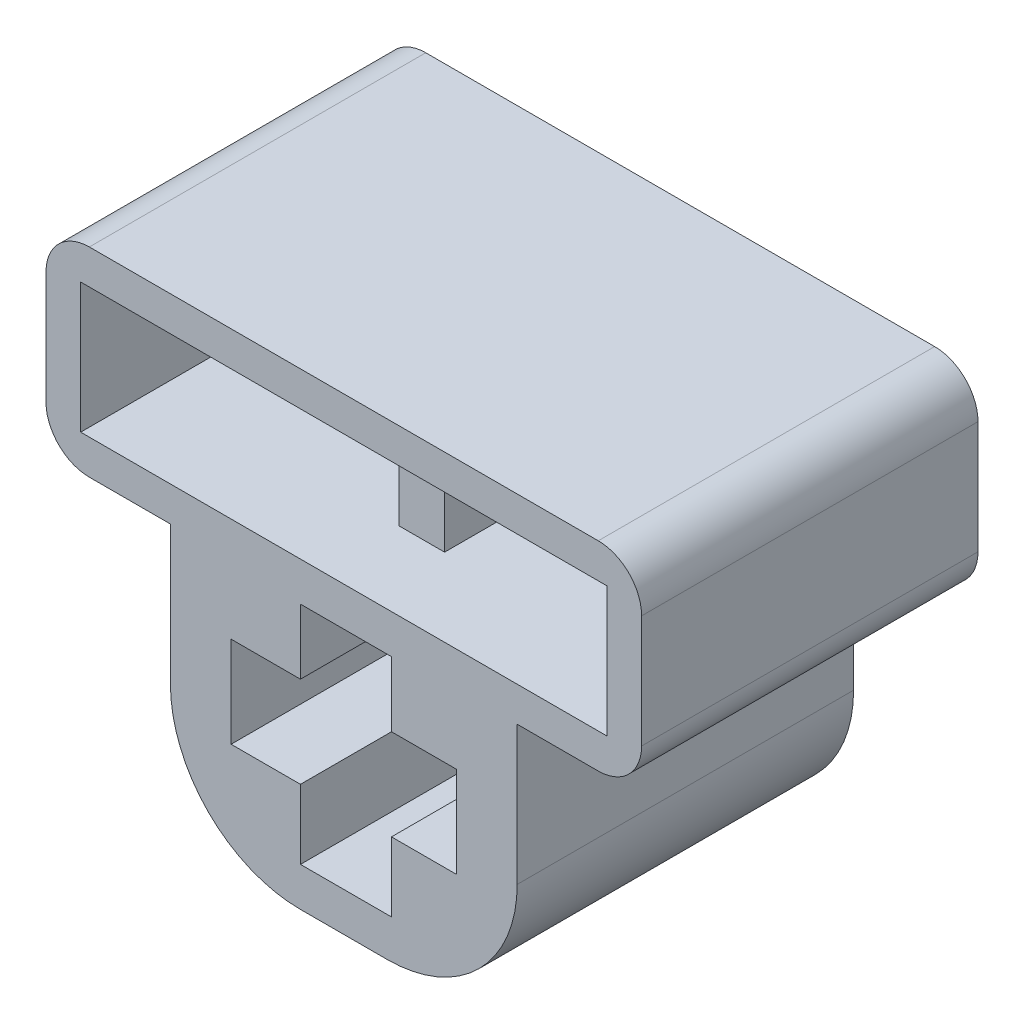
ISO-10303-21;
HEADER;
FILE_DESCRIPTION(('STEP AP214'),'2;1');
FILE_NAME('part.step','',(''),(''),'','','');
FILE_SCHEMA(('AUTOMOTIVE_DESIGN { 1 0 10303 214 1 1 1 1 }'));
ENDSEC;
DATA;
#1=APPLICATION_CONTEXT('core data for automotive mechanical design processes');
#2=APPLICATION_PROTOCOL_DEFINITION('international standard','automotive_design',2000,#1);
#3=PRODUCT_CONTEXT('',#1,'mechanical');
#4=PRODUCT('Part','Part','',(#3));
#5=PRODUCT_RELATED_PRODUCT_CATEGORY('part','',(#4));
#6=PRODUCT_DEFINITION_FORMATION('','',#4);
#7=PRODUCT_DEFINITION_CONTEXT('part definition',#1,'design');
#8=PRODUCT_DEFINITION('design','',#6,#7);
#9=PRODUCT_DEFINITION_SHAPE('','',#8);
#10=(LENGTH_UNIT() NAMED_UNIT(*) SI_UNIT(.MILLI.,.METRE.));
#11=(NAMED_UNIT(*) PLANE_ANGLE_UNIT() SI_UNIT($,.RADIAN.));
#12=(NAMED_UNIT(*) SI_UNIT($,.STERADIAN.) SOLID_ANGLE_UNIT());
#13=UNCERTAINTY_MEASURE_WITH_UNIT(LENGTH_MEASURE(1.E-05),#10,'distance_accuracy_value','');
#14=(GEOMETRIC_REPRESENTATION_CONTEXT(3) GLOBAL_UNCERTAINTY_ASSIGNED_CONTEXT((#13)) GLOBAL_UNIT_ASSIGNED_CONTEXT((#10,
#11,#12)) REPRESENTATION_CONTEXT('',''));
#15=CARTESIAN_POINT('',(0.,0.,0.));
#16=DIRECTION('',(0.,0.,1.));
#17=DIRECTION('',(1.,0.,0.));
#18=AXIS2_PLACEMENT_3D('',#15,#16,#17);
#19=CARTESIAN_POINT('',(-1.,-0.5,7.76));
#20=DIRECTION('',(0.,0.,1.));
#21=DIRECTION('',(1.,0.,0.));
#22=AXIS2_PLACEMENT_3D('',#19,#20,#21);
#23=CYLINDRICAL_SURFACE('',#22,3.);
#24=DIRECTION('',(0.,0.,1.));
#25=VECTOR('',#24,1.);
#26=CARTESIAN_POINT('',(-4.,-0.5,7.76));
#27=LINE('',#26,#25);
#28=CARTESIAN_POINT('',(-4.,-0.5,0.));
#29=VERTEX_POINT('',#28);
#30=CARTESIAN_POINT('',(-4.,-0.5,7.76));
#31=VERTEX_POINT('',#30);
#32=EDGE_CURVE('E523',#29,#31,#27,.T.);
#33=ORIENTED_EDGE('',*,*,#32,.F.);
#34=CARTESIAN_POINT('',(-1.,-0.5,0.));
#35=DIRECTION('',(0.,0.,1.));
#36=DIRECTION('',(1.,0.,0.));
#37=AXIS2_PLACEMENT_3D('',#34,#35,#36);
#38=CIRCLE('',#37,3.);
#39=CARTESIAN_POINT('',(-1.,-3.5,0.));
#40=VERTEX_POINT('',#39);
#41=EDGE_CURVE('E44',#40,#29,#38,.F.);
#42=ORIENTED_EDGE('',*,*,#41,.F.);
#43=DIRECTION('',(0.,0.,1.));
#44=VECTOR('',#43,1.);
#45=CARTESIAN_POINT('',(-1.,-3.5,7.76));
#46=LINE('',#45,#44);
#47=CARTESIAN_POINT('',(-1.,-3.5,7.76));
#48=VERTEX_POINT('',#47);
#49=EDGE_CURVE('E526',#48,#40,#46,.F.);
#50=ORIENTED_EDGE('',*,*,#49,.F.);
#51=CARTESIAN_POINT('',(-1.,-0.5,7.76));
#52=DIRECTION('',(0.,0.,1.));
#53=DIRECTION('',(1.,0.,0.));
#54=AXIS2_PLACEMENT_3D('',#51,#52,#53);
#55=CIRCLE('',#54,3.);
#56=EDGE_CURVE('E11',#31,#48,#55,.T.);
#57=ORIENTED_EDGE('',*,*,#56,.F.);
#58=EDGE_LOOP('',(#33,#42,#50,#57));
#59=FACE_BOUND('',#58,.T.);
#60=ADVANCED_FACE('F37',(#59),#23,.T.);
#61=CARTESIAN_POINT('',(0.999999999999999,-0.5,7.76));
#62=DIRECTION('',(0.,0.,1.));
#63=DIRECTION('',(1.,0.,0.));
#64=AXIS2_PLACEMENT_3D('',#61,#62,#63);
#65=CYLINDRICAL_SURFACE('',#64,3.);
#66=DIRECTION('',(0.,0.,-1.));
#67=VECTOR('',#66,1.);
#68=CARTESIAN_POINT('',(4.,-0.5,7.76));
#69=LINE('',#68,#67);
#70=CARTESIAN_POINT('',(4.,-0.5,7.76));
#71=VERTEX_POINT('',#70);
#72=CARTESIAN_POINT('',(4.,-0.5,0.));
#73=VERTEX_POINT('',#72);
#74=EDGE_CURVE('E512',#71,#73,#69,.T.);
#75=ORIENTED_EDGE('',*,*,#74,.F.);
#76=CARTESIAN_POINT('',(0.999999999999999,-0.5,7.76));
#77=DIRECTION('',(0.,0.,1.));
#78=DIRECTION('',(1.,0.,0.));
#79=AXIS2_PLACEMENT_3D('',#76,#77,#78);
#80=CIRCLE('',#79,3.);
#81=CARTESIAN_POINT('',(0.999999999999999,-3.5,7.76));
#82=VERTEX_POINT('',#81);
#83=EDGE_CURVE('E518',#82,#71,#80,.T.);
#84=ORIENTED_EDGE('',*,*,#83,.F.);
#85=DIRECTION('',(0.,0.,-1.));
#86=VECTOR('',#85,1.);
#87=CARTESIAN_POINT('',(0.999999999999999,-3.5,7.76));
#88=LINE('',#87,#86);
#89=CARTESIAN_POINT('',(0.999999999999999,-3.5,0.));
#90=VERTEX_POINT('',#89);
#91=EDGE_CURVE('E515',#90,#82,#88,.F.);
#92=ORIENTED_EDGE('',*,*,#91,.F.);
#93=CARTESIAN_POINT('',(0.999999999999999,-0.5,0.));
#94=DIRECTION('',(0.,0.,1.));
#95=DIRECTION('',(1.,0.,0.));
#96=AXIS2_PLACEMENT_3D('',#93,#94,#95);
#97=CIRCLE('',#96,3.);
#98=EDGE_CURVE('E520',#73,#90,#97,.F.);
#99=ORIENTED_EDGE('',*,*,#98,.F.);
#100=EDGE_LOOP('',(#75,#84,#92,#99));
#101=FACE_BOUND('',#100,.T.);
#102=ADVANCED_FACE('F583',(#101),#65,.T.);
#103=CARTESIAN_POINT('',(5.87,3.7,7.76));
#104=DIRECTION('',(0.,0.,-1.));
#105=DIRECTION('',(-1.,0.,0.));
#106=AXIS2_PLACEMENT_3D('',#103,#104,#105);
#107=CYLINDRICAL_SURFACE('',#106,1.);
#108=DIRECTION('',(0.,0.,1.));
#109=VECTOR('',#108,1.);
#110=CARTESIAN_POINT('',(5.87,2.7,7.76));
#111=LINE('',#110,#109);
#112=CARTESIAN_POINT('',(5.87,2.7,0.));
#113=VERTEX_POINT('',#112);
#114=CARTESIAN_POINT('',(5.87,2.7,7.76));
#115=VERTEX_POINT('',#114);
#116=EDGE_CURVE('E502',#113,#115,#111,.T.);
#117=ORIENTED_EDGE('',*,*,#116,.F.);
#118=CARTESIAN_POINT('',(5.87,3.7,0.));
#119=DIRECTION('',(0.,0.,1.));
#120=DIRECTION('',(1.,0.,0.));
#121=AXIS2_PLACEMENT_3D('',#118,#119,#120);
#122=CIRCLE('',#121,1.);
#123=CARTESIAN_POINT('',(6.87,3.7,0.));
#124=VERTEX_POINT('',#123);
#125=EDGE_CURVE('E508',#124,#113,#122,.F.);
#126=ORIENTED_EDGE('',*,*,#125,.F.);
#127=DIRECTION('',(0.,0.,1.));
#128=VECTOR('',#127,1.);
#129=CARTESIAN_POINT('',(6.87,3.7,7.76));
#130=LINE('',#129,#128);
#131=CARTESIAN_POINT('',(6.87,3.7,7.76));
#132=VERTEX_POINT('',#131);
#133=EDGE_CURVE('E505',#132,#124,#130,.F.);
#134=ORIENTED_EDGE('',*,*,#133,.F.);
#135=CARTESIAN_POINT('',(5.87,3.7,7.76));
#136=DIRECTION('',(0.,0.,1.));
#137=DIRECTION('',(1.,0.,0.));
#138=AXIS2_PLACEMENT_3D('',#135,#136,#137);
#139=CIRCLE('',#138,1.);
#140=EDGE_CURVE('E510',#115,#132,#139,.T.);
#141=ORIENTED_EDGE('',*,*,#140,.F.);
#142=EDGE_LOOP('',(#117,#126,#134,#141));
#143=FACE_BOUND('',#142,.T.);
#144=ADVANCED_FACE('F570',(#143),#107,.T.);
#145=CARTESIAN_POINT('',(-5.87,3.7,0.));
#146=DIRECTION('',(0.,0.,1.));
#147=DIRECTION('',(1.,0.,0.));
#148=AXIS2_PLACEMENT_3D('',#145,#146,#147);
#149=CYLINDRICAL_SURFACE('',#148,1.);
#150=DIRECTION('',(0.,0.,-1.));
#151=VECTOR('',#150,1.);
#152=CARTESIAN_POINT('',(-5.87,2.7,0.));
#153=LINE('',#152,#151);
#154=CARTESIAN_POINT('',(-5.87,2.7,7.76));
#155=VERTEX_POINT('',#154);
#156=CARTESIAN_POINT('',(-5.87,2.7,0.));
#157=VERTEX_POINT('',#156);
#158=EDGE_CURVE('E492',#155,#157,#153,.T.);
#159=ORIENTED_EDGE('',*,*,#158,.F.);
#160=CARTESIAN_POINT('',(-5.87,3.7,7.76));
#161=DIRECTION('',(0.,0.,1.));
#162=DIRECTION('',(1.,0.,0.));
#163=AXIS2_PLACEMENT_3D('',#160,#161,#162);
#164=CIRCLE('',#163,1.);
#165=CARTESIAN_POINT('',(-6.87,3.7,7.76));
#166=VERTEX_POINT('',#165);
#167=EDGE_CURVE('E498',#166,#155,#164,.T.);
#168=ORIENTED_EDGE('',*,*,#167,.F.);
#169=DIRECTION('',(0.,0.,-1.));
#170=VECTOR('',#169,1.);
#171=CARTESIAN_POINT('',(-6.87,3.7,0.));
#172=LINE('',#171,#170);
#173=CARTESIAN_POINT('',(-6.87,3.7,0.));
#174=VERTEX_POINT('',#173);
#175=EDGE_CURVE('E495',#174,#166,#172,.F.);
#176=ORIENTED_EDGE('',*,*,#175,.F.);
#177=CARTESIAN_POINT('',(-5.87,3.7,0.));
#178=DIRECTION('',(0.,0.,1.));
#179=DIRECTION('',(1.,0.,0.));
#180=AXIS2_PLACEMENT_3D('',#177,#178,#179);
#181=CIRCLE('',#180,1.);
#182=EDGE_CURVE('E500',#157,#174,#181,.F.);
#183=ORIENTED_EDGE('',*,*,#182,.F.);
#184=EDGE_LOOP('',(#159,#168,#176,#183));
#185=FACE_BOUND('',#184,.T.);
#186=ADVANCED_FACE('F543',(#185),#149,.T.);
#187=CARTESIAN_POINT('',(5.87,6.3,0.));
#188=DIRECTION('',(0.,0.,1.));
#189=DIRECTION('',(1.,0.,0.));
#190=AXIS2_PLACEMENT_3D('',#187,#188,#189);
#191=CYLINDRICAL_SURFACE('',#190,1.);
#192=DIRECTION('',(0.,0.,1.));
#193=VECTOR('',#192,1.);
#194=CARTESIAN_POINT('',(6.87,6.3,0.));
#195=LINE('',#194,#193);
#196=CARTESIAN_POINT('',(6.87,6.3,0.));
#197=VERTEX_POINT('',#196);
#198=CARTESIAN_POINT('',(6.87,6.3,7.76));
#199=VERTEX_POINT('',#198);
#200=EDGE_CURVE('E481',#197,#199,#195,.T.);
#201=ORIENTED_EDGE('',*,*,#200,.F.);
#202=CARTESIAN_POINT('',(5.87,6.3,0.));
#203=DIRECTION('',(0.,0.,1.));
#204=DIRECTION('',(1.,0.,0.));
#205=AXIS2_PLACEMENT_3D('',#202,#203,#204);
#206=CIRCLE('',#205,1.);
#207=CARTESIAN_POINT('',(5.87,7.3,0.));
#208=VERTEX_POINT('',#207);
#209=EDGE_CURVE('E487',#208,#197,#206,.F.);
#210=ORIENTED_EDGE('',*,*,#209,.F.);
#211=DIRECTION('',(0.,0.,1.));
#212=VECTOR('',#211,1.);
#213=CARTESIAN_POINT('',(5.87,7.3,0.));
#214=LINE('',#213,#212);
#215=CARTESIAN_POINT('',(5.87,7.3,7.76));
#216=VERTEX_POINT('',#215);
#217=EDGE_CURVE('E484',#216,#208,#214,.F.);
#218=ORIENTED_EDGE('',*,*,#217,.F.);
#219=CARTESIAN_POINT('',(5.87,6.3,7.76));
#220=DIRECTION('',(0.,0.,1.));
#221=DIRECTION('',(1.,0.,0.));
#222=AXIS2_PLACEMENT_3D('',#219,#220,#221);
#223=CIRCLE('',#222,1.);
#224=EDGE_CURVE('E490',#199,#216,#223,.T.);
#225=ORIENTED_EDGE('',*,*,#224,.F.);
#226=EDGE_LOOP('',(#201,#210,#218,#225));
#227=FACE_BOUND('',#226,.T.);
#228=ADVANCED_FACE('F559',(#227),#191,.T.);
#229=CARTESIAN_POINT('',(-5.87000000000001,6.3,0.));
#230=DIRECTION('',(0.,0.,-1.));
#231=DIRECTION('',(-1.,0.,0.));
#232=AXIS2_PLACEMENT_3D('',#229,#230,#231);
#233=CYLINDRICAL_SURFACE('',#232,1.);
#234=DIRECTION('',(0.,0.,-1.));
#235=VECTOR('',#234,1.);
#236=CARTESIAN_POINT('',(-6.87000000000001,6.3,0.));
#237=LINE('',#236,#235);
#238=CARTESIAN_POINT('',(-6.87,6.3,7.76));
#239=VERTEX_POINT('',#238);
#240=CARTESIAN_POINT('',(-6.87,6.3,0.));
#241=VERTEX_POINT('',#240);
#242=EDGE_CURVE('E461',#239,#241,#237,.T.);
#243=ORIENTED_EDGE('',*,*,#242,.F.);
#244=CARTESIAN_POINT('',(-5.87000000000001,6.3,7.76));
#245=DIRECTION('',(0.,0.,1.));
#246=DIRECTION('',(1.,0.,0.));
#247=AXIS2_PLACEMENT_3D('',#244,#245,#246);
#248=CIRCLE('',#247,1.);
#249=CARTESIAN_POINT('',(-5.87,7.3,7.76));
#250=VERTEX_POINT('',#249);
#251=EDGE_CURVE('E475',#250,#239,#248,.T.);
#252=ORIENTED_EDGE('',*,*,#251,.F.);
#253=DIRECTION('',(0.,0.,-1.));
#254=VECTOR('',#253,1.);
#255=CARTESIAN_POINT('',(-5.87000000000001,7.3,0.));
#256=LINE('',#255,#254);
#257=CARTESIAN_POINT('',(-5.87,7.3,0.));
#258=VERTEX_POINT('',#257);
#259=EDGE_CURVE('E472',#258,#250,#256,.F.);
#260=ORIENTED_EDGE('',*,*,#259,.F.);
#261=CARTESIAN_POINT('',(-5.87000000000001,6.3,0.));
#262=DIRECTION('',(0.,0.,1.));
#263=DIRECTION('',(1.,0.,0.));
#264=AXIS2_PLACEMENT_3D('',#261,#262,#263);
#265=CIRCLE('',#264,1.);
#266=EDGE_CURVE('E478',#241,#258,#265,.F.);
#267=ORIENTED_EDGE('',*,*,#266,.F.);
#268=EDGE_LOOP('',(#243,#252,#260,#267));
#269=FACE_BOUND('',#268,.T.);
#270=ADVANCED_FACE('F549',(#269),#233,.T.);
#271=CARTESIAN_POINT('',(0.,3.5,7.76));
#272=DIRECTION('',(0.,1.,0.));
#273=DIRECTION('',(0.,0.,1.));
#274=AXIS2_PLACEMENT_3D('',#271,#272,#273);
#275=PLANE('',#274);
#276=DIRECTION('',(1.,0.,0.));
#277=VECTOR('',#276,1.);
#278=CARTESIAN_POINT('',(0.,3.5,0.));
#279=LINE('',#278,#277);
#280=CARTESIAN_POINT('',(-6.07,3.5,0.));
#281=VERTEX_POINT('',#280);
#282=CARTESIAN_POINT('',(6.07,3.5,0.));
#283=VERTEX_POINT('',#282);
#284=EDGE_CURVE('E464',#281,#283,#279,.T.);
#285=ORIENTED_EDGE('',*,*,#284,.F.);
#286=DIRECTION('',(0.,0.,-1.));
#287=VECTOR('',#286,1.);
#288=CARTESIAN_POINT('',(-6.07,3.5,7.76));
#289=LINE('',#288,#287);
#290=CARTESIAN_POINT('',(-6.07,3.5,7.76));
#291=VERTEX_POINT('',#290);
#292=EDGE_CURVE('E304',#291,#281,#289,.T.);
#293=ORIENTED_EDGE('',*,*,#292,.F.);
#294=DIRECTION('',(1.,0.,0.));
#295=VECTOR('',#294,1.);
#296=CARTESIAN_POINT('',(0.,3.5,7.76));
#297=LINE('',#296,#295);
#298=CARTESIAN_POINT('',(6.07,3.5,7.76));
#299=VERTEX_POINT('',#298);
#300=EDGE_CURVE('E454',#291,#299,#297,.T.);
#301=ORIENTED_EDGE('',*,*,#300,.T.);
#302=DIRECTION('',(0.,0.,1.));
#303=VECTOR('',#302,1.);
#304=CARTESIAN_POINT('',(6.07,3.5,7.76));
#305=LINE('',#304,#303);
#306=EDGE_CURVE('E318',#283,#299,#305,.T.);
#307=ORIENTED_EDGE('',*,*,#306,.F.);
#308=EDGE_LOOP('',(#285,#293,#301,#307));
#309=FACE_BOUND('',#308,.T.);
#310=DIRECTION('',(-1.,0.,0.));
#311=VECTOR('',#310,1.);
#312=CARTESIAN_POINT('',(0.525000003347265,3.5,0.00379452149050152));
#313=LINE('',#312,#311);
#314=CARTESIAN_POINT('',(0.525000003347265,3.5,0.00379452149050152));
#315=VERTEX_POINT('',#314);
#316=CARTESIAN_POINT('',(-0.524999996652735,3.5,0.00379452149050165));
#317=VERTEX_POINT('',#316);
#318=EDGE_CURVE('E260',#315,#317,#313,.T.);
#319=ORIENTED_EDGE('',*,*,#318,.F.);
#320=DIRECTION('',(-8.81563610781225E-07,0.,-0.999999999999611));
#321=VECTOR('',#320,1.);
#322=CARTESIAN_POINT('',(0.525000003347265,3.5,0.00379452149050152));
#323=LINE('',#322,#321);
#324=CARTESIAN_POINT('',(0.525005254121273,3.5,5.96));
#325=VERTEX_POINT('',#324);
#326=EDGE_CURVE('E269',#325,#315,#323,.T.);
#327=ORIENTED_EDGE('',*,*,#326,.F.);
#328=DIRECTION('',(1.,0.,0.));
#329=VECTOR('',#328,1.);
#330=CARTESIAN_POINT('',(0.525005254121273,3.5,5.96));
#331=LINE('',#330,#329);
#332=CARTESIAN_POINT('',(-0.524994745878727,3.5,5.96));
#333=VERTEX_POINT('',#332);
#334=EDGE_CURVE('E280',#333,#325,#331,.T.);
#335=ORIENTED_EDGE('',*,*,#334,.F.);
#336=DIRECTION('',(8.81563610781225E-07,0.,0.999999999999611));
#337=VECTOR('',#336,1.);
#338=CARTESIAN_POINT('',(-0.524999996652735,3.5,0.00379452149050165));
#339=LINE('',#338,#337);
#340=EDGE_CURVE('E278',#317,#333,#339,.T.);
#341=ORIENTED_EDGE('',*,*,#340,.F.);
#342=EDGE_LOOP('',(#319,#327,#335,#341));
#343=FACE_BOUND('',#342,.T.);
#344=ADVANCED_FACE('F277',(#309,#343),#275,.T.);
#345=CARTESIAN_POINT('',(0.,6.5,0.));
#346=DIRECTION('',(0.,1.,0.));
#347=DIRECTION('',(0.,0.,1.));
#348=AXIS2_PLACEMENT_3D('',#345,#346,#347);
#349=PLANE('',#348);
#350=DIRECTION('',(-1.,0.,0.));
#351=VECTOR('',#350,1.);
#352=CARTESIAN_POINT('',(6.87,6.5,0.));
#353=LINE('',#352,#351);
#354=CARTESIAN_POINT('',(6.07,6.5,0.));
#355=VERTEX_POINT('',#354);
#356=CARTESIAN_POINT('',(-6.07,6.5,0.));
#357=VERTEX_POINT('',#356);
#358=EDGE_CURVE('E297',#355,#357,#353,.T.);
#359=ORIENTED_EDGE('',*,*,#358,.F.);
#360=DIRECTION('',(0.,0.,1.));
#361=VECTOR('',#360,1.);
#362=CARTESIAN_POINT('',(6.07,6.5,7.76));
#363=LINE('',#362,#361);
#364=CARTESIAN_POINT('',(6.07,6.5,7.76));
#365=VERTEX_POINT('',#364);
#366=EDGE_CURVE('E319',#355,#365,#363,.T.);
#367=ORIENTED_EDGE('',*,*,#366,.T.);
#368=DIRECTION('',(1.,0.,0.));
#369=VECTOR('',#368,1.);
#370=CARTESIAN_POINT('',(6.87,6.5,7.76));
#371=LINE('',#370,#369);
#372=CARTESIAN_POINT('',(-6.07,6.5,7.76));
#373=VERTEX_POINT('',#372);
#374=EDGE_CURVE('E301',#373,#365,#371,.T.);
#375=ORIENTED_EDGE('',*,*,#374,.F.);
#376=DIRECTION('',(0.,0.,-1.));
#377=VECTOR('',#376,1.);
#378=CARTESIAN_POINT('',(-6.07,6.5,7.76));
#379=LINE('',#378,#377);
#380=EDGE_CURVE('E309',#373,#357,#379,.T.);
#381=ORIENTED_EDGE('',*,*,#380,.T.);
#382=EDGE_LOOP('',(#359,#367,#375,#381));
#383=FACE_BOUND('',#382,.T.);
#384=DIRECTION('',(8.81563610781225E-07,0.,0.999999999999612));
#385=VECTOR('',#384,1.);
#386=CARTESIAN_POINT('',(0.525000000001745,6.5,-4.62820895661861E-07));
#387=LINE('',#386,#385);
#388=CARTESIAN_POINT('',(0.525000003347265,6.5,0.00379452149050152));
#389=VERTEX_POINT('',#388);
#390=CARTESIAN_POINT('',(0.525005254121273,6.5,5.96));
#391=VERTEX_POINT('',#390);
#392=EDGE_CURVE('E295',#389,#391,#387,.T.);
#393=ORIENTED_EDGE('',*,*,#392,.F.);
#394=DIRECTION('',(1.,0.,0.));
#395=VECTOR('',#394,1.);
#396=CARTESIAN_POINT('',(0.,6.5,0.00379452149050159));
#397=LINE('',#396,#395);
#398=CARTESIAN_POINT('',(-0.524999996652735,6.5,0.00379452149050165));
#399=VERTEX_POINT('',#398);
#400=EDGE_CURVE('E262',#399,#389,#397,.T.);
#401=ORIENTED_EDGE('',*,*,#400,.F.);
#402=DIRECTION('',(-8.81563610781225E-07,0.,-0.999999999999612));
#403=VECTOR('',#402,1.);
#404=CARTESIAN_POINT('',(-0.524999999997439,6.5,4.62820895658065E-07));
#405=LINE('',#404,#403);
#406=CARTESIAN_POINT('',(-0.524994745878727,6.5,5.96));
#407=VERTEX_POINT('',#406);
#408=EDGE_CURVE('E291',#407,#399,#405,.T.);
#409=ORIENTED_EDGE('',*,*,#408,.F.);
#410=DIRECTION('',(-1.,0.,0.));
#411=VECTOR('',#410,1.);
#412=CARTESIAN_POINT('',(0.,6.5,5.96));
#413=LINE('',#412,#411);
#414=EDGE_CURVE('E265',#391,#407,#413,.T.);
#415=ORIENTED_EDGE('',*,*,#414,.F.);
#416=EDGE_LOOP('',(#393,#401,#409,#415));
#417=FACE_BOUND('',#416,.T.);
#418=ADVANCED_FACE('F612',(#383,#417),#349,.F.);
#419=CARTESIAN_POINT('',(-4.,0.,7.76));
#420=DIRECTION('',(1.,0.,0.));
#421=DIRECTION('',(0.,0.,-1.));
#422=AXIS2_PLACEMENT_3D('',#419,#420,#421);
#423=PLANE('',#422);
#424=DIRECTION('',(0.,-1.,0.));
#425=VECTOR('',#424,1.);
#426=CARTESIAN_POINT('',(-4.,0.,0.));
#427=LINE('',#426,#425);
#428=CARTESIAN_POINT('',(-4.,2.7,0.));
#429=VERTEX_POINT('',#428);
#430=EDGE_CURVE('E466',#429,#29,#427,.T.);
#431=ORIENTED_EDGE('',*,*,#430,.T.);
#432=ORIENTED_EDGE('',*,*,#32,.T.);
#433=DIRECTION('',(0.,-1.,0.));
#434=VECTOR('',#433,1.);
#435=CARTESIAN_POINT('',(-4.,0.,7.76));
#436=LINE('',#435,#434);
#437=CARTESIAN_POINT('',(-4.,2.7,7.76));
#438=VERTEX_POINT('',#437);
#439=EDGE_CURVE('E457',#438,#31,#436,.T.);
#440=ORIENTED_EDGE('',*,*,#439,.F.);
#441=DIRECTION('',(0.,0.,1.));
#442=VECTOR('',#441,1.);
#443=CARTESIAN_POINT('',(-4.,2.7,0.));
#444=LINE('',#443,#442);
#445=EDGE_CURVE('E342',#429,#438,#444,.T.);
#446=ORIENTED_EDGE('',*,*,#445,.F.);
#447=EDGE_LOOP('',(#431,#432,#440,#446));
#448=FACE_BOUND('',#447,.T.);
#449=ADVANCED_FACE('F535',(#448),#423,.F.);
#450=CARTESIAN_POINT('',(4.,0.,7.76));
#451=DIRECTION('',(1.,0.,0.));
#452=DIRECTION('',(0.,0.,-1.));
#453=AXIS2_PLACEMENT_3D('',#450,#451,#452);
#454=PLANE('',#453);
#455=DIRECTION('',(0.,-1.,0.));
#456=VECTOR('',#455,1.);
#457=CARTESIAN_POINT('',(4.,0.,7.76));
#458=LINE('',#457,#456);
#459=CARTESIAN_POINT('',(4.,2.7,7.76));
#460=VERTEX_POINT('',#459);
#461=EDGE_CURVE('E451',#460,#71,#458,.T.);
#462=ORIENTED_EDGE('',*,*,#461,.T.);
#463=ORIENTED_EDGE('',*,*,#74,.T.);
#464=DIRECTION('',(0.,-1.,0.));
#465=VECTOR('',#464,1.);
#466=CARTESIAN_POINT('',(4.,0.,0.));
#467=LINE('',#466,#465);
#468=CARTESIAN_POINT('',(4.,2.7,0.));
#469=VERTEX_POINT('',#468);
#470=EDGE_CURVE('E428',#469,#73,#467,.T.);
#471=ORIENTED_EDGE('',*,*,#470,.F.);
#472=DIRECTION('',(0.,0.,-1.));
#473=VECTOR('',#472,1.);
#474=CARTESIAN_POINT('',(4.,2.7,7.76));
#475=LINE('',#474,#473);
#476=EDGE_CURVE('E330',#460,#469,#475,.T.);
#477=ORIENTED_EDGE('',*,*,#476,.F.);
#478=EDGE_LOOP('',(#462,#463,#471,#477));
#479=FACE_BOUND('',#478,.T.);
#480=ADVANCED_FACE('F577',(#479),#454,.T.);
#481=CARTESIAN_POINT('',(0.,-3.5,7.76));
#482=DIRECTION('',(0.,1.,0.));
#483=DIRECTION('',(0.,0.,1.));
#484=AXIS2_PLACEMENT_3D('',#481,#482,#483);
#485=PLANE('',#484);
#486=DIRECTION('',(1.,0.,0.));
#487=VECTOR('',#486,1.);
#488=CARTESIAN_POINT('',(0.,-3.5,7.76));
#489=LINE('',#488,#487);
#490=EDGE_CURVE('E459',#48,#82,#489,.T.);
#491=ORIENTED_EDGE('',*,*,#490,.F.);
#492=ORIENTED_EDGE('',*,*,#49,.T.);
#493=DIRECTION('',(1.,0.,0.));
#494=VECTOR('',#493,1.);
#495=CARTESIAN_POINT('',(0.,-3.5,0.));
#496=LINE('',#495,#494);
#497=EDGE_CURVE('E455',#40,#90,#496,.T.);
#498=ORIENTED_EDGE('',*,*,#497,.T.);
#499=ORIENTED_EDGE('',*,*,#91,.T.);
#500=EDGE_LOOP('',(#491,#492,#498,#499));
#501=FACE_BOUND('',#500,.T.);
#502=ADVANCED_FACE('F585',(#501),#485,.F.);
#503=CARTESIAN_POINT('',(0.,0.,7.76));
#504=DIRECTION('',(0.,0.,1.));
#505=DIRECTION('',(1.,0.,0.));
#506=AXIS2_PLACEMENT_3D('',#503,#504,#505);
#507=PLANE('',#506);
#508=ORIENTED_EDGE('',*,*,#439,.T.);
#509=ORIENTED_EDGE('',*,*,#56,.T.);
#510=ORIENTED_EDGE('',*,*,#490,.T.);
#511=ORIENTED_EDGE('',*,*,#83,.T.);
#512=ORIENTED_EDGE('',*,*,#461,.F.);
#513=DIRECTION('',(-1.,0.,0.));
#514=VECTOR('',#513,1.);
#515=CARTESIAN_POINT('',(6.87,2.7,7.76));
#516=LINE('',#515,#514);
#517=EDGE_CURVE('E340',#115,#460,#516,.T.);
#518=ORIENTED_EDGE('',*,*,#517,.F.);
#519=ORIENTED_EDGE('',*,*,#140,.T.);
#520=DIRECTION('',(0.,-1.,0.));
#521=VECTOR('',#520,1.);
#522=CARTESIAN_POINT('',(6.87,3.5,7.76));
#523=LINE('',#522,#521);
#524=EDGE_CURVE('E331',#199,#132,#523,.T.);
#525=ORIENTED_EDGE('',*,*,#524,.F.);
#526=ORIENTED_EDGE('',*,*,#224,.T.);
#527=DIRECTION('',(1.,0.,0.));
#528=VECTOR('',#527,1.);
#529=CARTESIAN_POINT('',(6.87,7.3,7.76));
#530=LINE('',#529,#528);
#531=EDGE_CURVE('E300',#250,#216,#530,.T.);
#532=ORIENTED_EDGE('',*,*,#531,.F.);
#533=ORIENTED_EDGE('',*,*,#251,.T.);
#534=DIRECTION('',(0.,1.,0.));
#535=VECTOR('',#534,1.);
#536=CARTESIAN_POINT('',(-6.87,3.5,7.76));
#537=LINE('',#536,#535);
#538=EDGE_CURVE('E346',#166,#239,#537,.T.);
#539=ORIENTED_EDGE('',*,*,#538,.F.);
#540=ORIENTED_EDGE('',*,*,#167,.T.);
#541=DIRECTION('',(1.,0.,0.));
#542=VECTOR('',#541,1.);
#543=CARTESIAN_POINT('',(-6.87,2.7,7.76));
#544=LINE('',#543,#542);
#545=EDGE_CURVE('E348',#155,#438,#544,.T.);
#546=ORIENTED_EDGE('',*,*,#545,.T.);
#547=EDGE_LOOP('',(#508,#509,#510,#511,#512,#518,#519,#525,#526,#532,#533,#539,#540,#546));
#548=FACE_BOUND('',#547,.T.);
#549=DIRECTION('',(0.,1.,0.));
#550=VECTOR('',#549,1.);
#551=CARTESIAN_POINT('',(2.6,1.1,7.76));
#552=LINE('',#551,#550);
#553=CARTESIAN_POINT('',(2.6,-1.,7.76));
#554=VERTEX_POINT('',#553);
#555=CARTESIAN_POINT('',(2.6,1.1,7.76));
#556=VERTEX_POINT('',#555);
#557=EDGE_CURVE('E354',#554,#556,#552,.T.);
#558=ORIENTED_EDGE('',*,*,#557,.F.);
#559=DIRECTION('',(1.,0.,0.));
#560=VECTOR('',#559,1.);
#561=CARTESIAN_POINT('',(1.1,-1.,7.76));
#562=LINE('',#561,#560);
#563=CARTESIAN_POINT('',(1.1,-1.,7.76));
#564=VERTEX_POINT('',#563);
#565=EDGE_CURVE('E359',#564,#554,#562,.T.);
#566=ORIENTED_EDGE('',*,*,#565,.F.);
#567=DIRECTION('',(0.,1.,0.));
#568=VECTOR('',#567,1.);
#569=CARTESIAN_POINT('',(1.1,-1.,7.76));
#570=LINE('',#569,#568);
#571=CARTESIAN_POINT('',(1.1,-2.6,7.76));
#572=VERTEX_POINT('',#571);
#573=EDGE_CURVE('E421',#572,#564,#570,.T.);
#574=ORIENTED_EDGE('',*,*,#573,.F.);
#575=DIRECTION('',(1.,0.,0.));
#576=VECTOR('',#575,1.);
#577=CARTESIAN_POINT('',(-1.,-2.6,7.76));
#578=LINE('',#577,#576);
#579=CARTESIAN_POINT('',(-1.,-2.6,7.76));
#580=VERTEX_POINT('',#579);
#581=EDGE_CURVE('E418',#580,#572,#578,.T.);
#582=ORIENTED_EDGE('',*,*,#581,.F.);
#583=DIRECTION('',(0.,-1.,0.));
#584=VECTOR('',#583,1.);
#585=CARTESIAN_POINT('',(-1.,-1.,7.76));
#586=LINE('',#585,#584);
#587=CARTESIAN_POINT('',(-1.,-1.,7.76));
#588=VERTEX_POINT('',#587);
#589=EDGE_CURVE('E415',#588,#580,#586,.T.);
#590=ORIENTED_EDGE('',*,*,#589,.F.);
#591=DIRECTION('',(1.,0.,0.));
#592=VECTOR('',#591,1.);
#593=CARTESIAN_POINT('',(-2.6,-1.,7.76));
#594=LINE('',#593,#592);
#595=CARTESIAN_POINT('',(-2.6,-1.,7.76));
#596=VERTEX_POINT('',#595);
#597=EDGE_CURVE('E412',#596,#588,#594,.T.);
#598=ORIENTED_EDGE('',*,*,#597,.F.);
#599=DIRECTION('',(0.,-1.,0.));
#600=VECTOR('',#599,1.);
#601=CARTESIAN_POINT('',(-2.6,1.1,7.76));
#602=LINE('',#601,#600);
#603=CARTESIAN_POINT('',(-2.6,1.1,7.76));
#604=VERTEX_POINT('',#603);
#605=EDGE_CURVE('E409',#604,#596,#602,.T.);
#606=ORIENTED_EDGE('',*,*,#605,.F.);
#607=DIRECTION('',(-1.,0.,0.));
#608=VECTOR('',#607,1.);
#609=CARTESIAN_POINT('',(-2.6,1.1,7.76));
#610=LINE('',#609,#608);
#611=CARTESIAN_POINT('',(-1.,1.1,7.76));
#612=VERTEX_POINT('',#611);
#613=EDGE_CURVE('E406',#612,#604,#610,.T.);
#614=ORIENTED_EDGE('',*,*,#613,.F.);
#615=DIRECTION('',(0.,-1.,0.));
#616=VECTOR('',#615,1.);
#617=CARTESIAN_POINT('',(-1.,2.6,7.76));
#618=LINE('',#617,#616);
#619=CARTESIAN_POINT('',(-1.,2.6,7.76));
#620=VERTEX_POINT('',#619);
#621=EDGE_CURVE('E403',#620,#612,#618,.T.);
#622=ORIENTED_EDGE('',*,*,#621,.F.);
#623=DIRECTION('',(-1.,0.,0.));
#624=VECTOR('',#623,1.);
#625=CARTESIAN_POINT('',(-1.,2.6,7.76));
#626=LINE('',#625,#624);
#627=CARTESIAN_POINT('',(1.1,2.6,7.76));
#628=VERTEX_POINT('',#627);
#629=EDGE_CURVE('E400',#628,#620,#626,.T.);
#630=ORIENTED_EDGE('',*,*,#629,.F.);
#631=DIRECTION('',(0.,1.,0.));
#632=VECTOR('',#631,1.);
#633=CARTESIAN_POINT('',(1.1,2.6,7.76));
#634=LINE('',#633,#632);
#635=CARTESIAN_POINT('',(1.1,1.1,7.76));
#636=VERTEX_POINT('',#635);
#637=EDGE_CURVE('E397',#636,#628,#634,.T.);
#638=ORIENTED_EDGE('',*,*,#637,.F.);
#639=DIRECTION('',(-1.,0.,0.));
#640=VECTOR('',#639,1.);
#641=CARTESIAN_POINT('',(1.1,1.1,7.76));
#642=LINE('',#641,#640);
#643=EDGE_CURVE('E394',#556,#636,#642,.T.);
#644=ORIENTED_EDGE('',*,*,#643,.F.);
#645=EDGE_LOOP('',(#558,#566,#574,#582,#590,#598,#606,#614,#622,#630,#638,#644));
#646=FACE_BOUND('',#645,.T.);
#647=ORIENTED_EDGE('',*,*,#374,.T.);
#648=DIRECTION('',(0.,-1.,0.));
#649=VECTOR('',#648,1.);
#650=CARTESIAN_POINT('',(6.07,6.5,7.76));
#651=LINE('',#650,#649);
#652=EDGE_CURVE('E322',#365,#299,#651,.T.);
#653=ORIENTED_EDGE('',*,*,#652,.T.);
#654=ORIENTED_EDGE('',*,*,#300,.F.);
#655=DIRECTION('',(0.,-1.,0.));
#656=VECTOR('',#655,1.);
#657=CARTESIAN_POINT('',(-6.07,6.5,7.76));
#658=LINE('',#657,#656);
#659=EDGE_CURVE('E316',#373,#291,#658,.T.);
#660=ORIENTED_EDGE('',*,*,#659,.F.);
#661=EDGE_LOOP('',(#647,#653,#654,#660));
#662=FACE_BOUND('',#661,.T.);
#663=ADVANCED_FACE('F563',(#548,#646,#662),#507,.T.);
#664=CARTESIAN_POINT('',(0.,0.,0.));
#665=DIRECTION('',(0.,0.,1.));
#666=DIRECTION('',(1.,0.,0.));
#667=AXIS2_PLACEMENT_3D('',#664,#665,#666);
#668=PLANE('',#667);
#669=DIRECTION('',(0.,-1.,0.));
#670=VECTOR('',#669,1.);
#671=CARTESIAN_POINT('',(6.07,6.5,0.));
#672=LINE('',#671,#670);
#673=EDGE_CURVE('E327',#355,#283,#672,.T.);
#674=ORIENTED_EDGE('',*,*,#673,.F.);
#675=ORIENTED_EDGE('',*,*,#358,.T.);
#676=DIRECTION('',(0.,-1.,0.));
#677=VECTOR('',#676,1.);
#678=CARTESIAN_POINT('',(-6.07,6.5,0.));
#679=LINE('',#678,#677);
#680=EDGE_CURVE('E312',#357,#281,#679,.T.);
#681=ORIENTED_EDGE('',*,*,#680,.T.);
#682=ORIENTED_EDGE('',*,*,#284,.T.);
#683=EDGE_LOOP('',(#674,#675,#681,#682));
#684=FACE_BOUND('',#683,.T.);
#685=DIRECTION('',(1.,0.,0.));
#686=VECTOR('',#685,1.);
#687=CARTESIAN_POINT('',(1.1,-1.,0.));
#688=LINE('',#687,#686);
#689=CARTESIAN_POINT('',(1.1,-1.,0.));
#690=VERTEX_POINT('',#689);
#691=CARTESIAN_POINT('',(2.6,-1.,0.));
#692=VERTEX_POINT('',#691);
#693=EDGE_CURVE('E389',#690,#692,#688,.T.);
#694=ORIENTED_EDGE('',*,*,#693,.T.);
#695=DIRECTION('',(0.,1.,0.));
#696=VECTOR('',#695,1.);
#697=CARTESIAN_POINT('',(2.6,1.1,0.));
#698=LINE('',#697,#696);
#699=CARTESIAN_POINT('',(2.6,1.1,0.));
#700=VERTEX_POINT('',#699);
#701=EDGE_CURVE('E355',#692,#700,#698,.T.);
#702=ORIENTED_EDGE('',*,*,#701,.T.);
#703=DIRECTION('',(-1.,0.,0.));
#704=VECTOR('',#703,1.);
#705=CARTESIAN_POINT('',(1.1,1.1,0.));
#706=LINE('',#705,#704);
#707=CARTESIAN_POINT('',(1.1,1.1,0.));
#708=VERTEX_POINT('',#707);
#709=EDGE_CURVE('E358',#700,#708,#706,.T.);
#710=ORIENTED_EDGE('',*,*,#709,.T.);
#711=DIRECTION('',(0.,1.,0.));
#712=VECTOR('',#711,1.);
#713=CARTESIAN_POINT('',(1.1,2.6,0.));
#714=LINE('',#713,#712);
#715=CARTESIAN_POINT('',(1.1,2.6,0.));
#716=VERTEX_POINT('',#715);
#717=EDGE_CURVE('E362',#708,#716,#714,.T.);
#718=ORIENTED_EDGE('',*,*,#717,.T.);
#719=DIRECTION('',(-1.,0.,0.));
#720=VECTOR('',#719,1.);
#721=CARTESIAN_POINT('',(-1.,2.6,0.));
#722=LINE('',#721,#720);
#723=CARTESIAN_POINT('',(-1.,2.6,0.));
#724=VERTEX_POINT('',#723);
#725=EDGE_CURVE('E365',#716,#724,#722,.T.);
#726=ORIENTED_EDGE('',*,*,#725,.T.);
#727=DIRECTION('',(0.,-1.,0.));
#728=VECTOR('',#727,1.);
#729=CARTESIAN_POINT('',(-1.,2.6,0.));
#730=LINE('',#729,#728);
#731=CARTESIAN_POINT('',(-1.,1.1,0.));
#732=VERTEX_POINT('',#731);
#733=EDGE_CURVE('E368',#724,#732,#730,.T.);
#734=ORIENTED_EDGE('',*,*,#733,.T.);
#735=DIRECTION('',(-1.,0.,0.));
#736=VECTOR('',#735,1.);
#737=CARTESIAN_POINT('',(-2.6,1.1,0.));
#738=LINE('',#737,#736);
#739=CARTESIAN_POINT('',(-2.6,1.1,0.));
#740=VERTEX_POINT('',#739);
#741=EDGE_CURVE('E371',#732,#740,#738,.T.);
#742=ORIENTED_EDGE('',*,*,#741,.T.);
#743=DIRECTION('',(0.,-1.,0.));
#744=VECTOR('',#743,1.);
#745=CARTESIAN_POINT('',(-2.6,1.1,0.));
#746=LINE('',#745,#744);
#747=CARTESIAN_POINT('',(-2.6,-1.,0.));
#748=VERTEX_POINT('',#747);
#749=EDGE_CURVE('E374',#740,#748,#746,.T.);
#750=ORIENTED_EDGE('',*,*,#749,.T.);
#751=DIRECTION('',(1.,0.,0.));
#752=VECTOR('',#751,1.);
#753=CARTESIAN_POINT('',(-2.6,-1.,0.));
#754=LINE('',#753,#752);
#755=CARTESIAN_POINT('',(-1.,-1.,0.));
#756=VERTEX_POINT('',#755);
#757=EDGE_CURVE('E377',#748,#756,#754,.T.);
#758=ORIENTED_EDGE('',*,*,#757,.T.);
#759=DIRECTION('',(0.,-1.,0.));
#760=VECTOR('',#759,1.);
#761=CARTESIAN_POINT('',(-1.,-1.,0.));
#762=LINE('',#761,#760);
#763=CARTESIAN_POINT('',(-1.,-2.6,0.));
#764=VERTEX_POINT('',#763);
#765=EDGE_CURVE('E380',#756,#764,#762,.T.);
#766=ORIENTED_EDGE('',*,*,#765,.T.);
#767=DIRECTION('',(1.,0.,0.));
#768=VECTOR('',#767,1.);
#769=CARTESIAN_POINT('',(-1.,-2.6,0.));
#770=LINE('',#769,#768);
#771=CARTESIAN_POINT('',(1.1,-2.6,0.));
#772=VERTEX_POINT('',#771);
#773=EDGE_CURVE('E383',#764,#772,#770,.T.);
#774=ORIENTED_EDGE('',*,*,#773,.T.);
#775=DIRECTION('',(0.,1.,0.));
#776=VECTOR('',#775,1.);
#777=CARTESIAN_POINT('',(1.1,-1.,0.));
#778=LINE('',#777,#776);
#779=EDGE_CURVE('E386',#772,#690,#778,.T.);
#780=ORIENTED_EDGE('',*,*,#779,.T.);
#781=EDGE_LOOP('',(#694,#702,#710,#718,#726,#734,#742,#750,#758,#766,#774,#780));
#782=FACE_BOUND('',#781,.T.);
#783=ORIENTED_EDGE('',*,*,#497,.F.);
#784=ORIENTED_EDGE('',*,*,#41,.T.);
#785=ORIENTED_EDGE('',*,*,#430,.F.);
#786=DIRECTION('',(1.,0.,0.));
#787=VECTOR('',#786,1.);
#788=CARTESIAN_POINT('',(-6.87,2.7,0.));
#789=LINE('',#788,#787);
#790=EDGE_CURVE('E352',#157,#429,#789,.T.);
#791=ORIENTED_EDGE('',*,*,#790,.F.);
#792=ORIENTED_EDGE('',*,*,#182,.T.);
#793=DIRECTION('',(0.,-1.,0.));
#794=VECTOR('',#793,1.);
#795=CARTESIAN_POINT('',(-6.87,3.5,0.));
#796=LINE('',#795,#794);
#797=EDGE_CURVE('E343',#241,#174,#796,.T.);
#798=ORIENTED_EDGE('',*,*,#797,.F.);
#799=ORIENTED_EDGE('',*,*,#266,.T.);
#800=DIRECTION('',(-1.,0.,0.));
#801=VECTOR('',#800,1.);
#802=CARTESIAN_POINT('',(6.87,7.3,0.));
#803=LINE('',#802,#801);
#804=EDGE_CURVE('E298',#208,#258,#803,.T.);
#805=ORIENTED_EDGE('',*,*,#804,.F.);
#806=ORIENTED_EDGE('',*,*,#209,.T.);
#807=DIRECTION('',(0.,1.,0.));
#808=VECTOR('',#807,1.);
#809=CARTESIAN_POINT('',(6.87,3.5,0.));
#810=LINE('',#809,#808);
#811=EDGE_CURVE('E334',#124,#197,#810,.T.);
#812=ORIENTED_EDGE('',*,*,#811,.F.);
#813=ORIENTED_EDGE('',*,*,#125,.T.);
#814=DIRECTION('',(-1.,0.,0.));
#815=VECTOR('',#814,1.);
#816=CARTESIAN_POINT('',(6.87,2.7,0.));
#817=LINE('',#816,#815);
#818=EDGE_CURVE('E336',#113,#469,#817,.T.);
#819=ORIENTED_EDGE('',*,*,#818,.T.);
#820=ORIENTED_EDGE('',*,*,#470,.T.);
#821=ORIENTED_EDGE('',*,*,#98,.T.);
#822=EDGE_LOOP('',(#783,#784,#785,#791,#792,#798,#799,#805,#806,#812,#813,#819,#820,#821));
#823=FACE_BOUND('',#822,.T.);
#824=ADVANCED_FACE('F530',(#684,#782,#823),#668,.F.);
#825=CARTESIAN_POINT('',(2.6,1.1,0.));
#826=DIRECTION('',(1.,0.,0.));
#827=DIRECTION('',(0.,0.,-1.));
#828=AXIS2_PLACEMENT_3D('',#825,#826,#827);
#829=PLANE('',#828);
#830=ORIENTED_EDGE('',*,*,#557,.T.);
#831=DIRECTION('',(0.,0.,1.));
#832=VECTOR('',#831,1.);
#833=CARTESIAN_POINT('',(2.6,1.1,0.));
#834=LINE('',#833,#832);
#835=EDGE_CURVE('E392',#700,#556,#834,.T.);
#836=ORIENTED_EDGE('',*,*,#835,.F.);
#837=ORIENTED_EDGE('',*,*,#701,.F.);
#838=DIRECTION('',(0.,0.,1.));
#839=VECTOR('',#838,1.);
#840=CARTESIAN_POINT('',(2.6,-1.,0.));
#841=LINE('',#840,#839);
#842=EDGE_CURVE('E426',#692,#554,#841,.T.);
#843=ORIENTED_EDGE('',*,*,#842,.T.);
#844=EDGE_LOOP('',(#830,#836,#837,#843));
#845=FACE_BOUND('',#844,.T.);
#846=ADVANCED_FACE('F648',(#845),#829,.F.);
#847=CARTESIAN_POINT('',(1.1,-1.,0.));
#848=DIRECTION('',(0.,-1.,0.));
#849=DIRECTION('',(1.,0.,0.));
#850=AXIS2_PLACEMENT_3D('',#847,#848,#849);
#851=PLANE('',#850);
#852=ORIENTED_EDGE('',*,*,#565,.T.);
#853=ORIENTED_EDGE('',*,*,#842,.F.);
#854=ORIENTED_EDGE('',*,*,#693,.F.);
#855=DIRECTION('',(0.,0.,1.));
#856=VECTOR('',#855,1.);
#857=CARTESIAN_POINT('',(1.1,-1.,0.));
#858=LINE('',#857,#856);
#859=EDGE_CURVE('E429',#690,#564,#858,.T.);
#860=ORIENTED_EDGE('',*,*,#859,.T.);
#861=EDGE_LOOP('',(#852,#853,#854,#860));
#862=FACE_BOUND('',#861,.T.);
#863=ADVANCED_FACE('F644',(#862),#851,.F.);
#864=CARTESIAN_POINT('',(1.1,-1.,0.));
#865=DIRECTION('',(1.,0.,0.));
#866=DIRECTION('',(0.,1.,0.));
#867=AXIS2_PLACEMENT_3D('',#864,#865,#866);
#868=PLANE('',#867);
#869=ORIENTED_EDGE('',*,*,#573,.T.);
#870=ORIENTED_EDGE('',*,*,#859,.F.);
#871=ORIENTED_EDGE('',*,*,#779,.F.);
#872=DIRECTION('',(0.,0.,1.));
#873=VECTOR('',#872,1.);
#874=CARTESIAN_POINT('',(1.1,-2.6,0.));
#875=LINE('',#874,#873);
#876=EDGE_CURVE('E431',#772,#572,#875,.T.);
#877=ORIENTED_EDGE('',*,*,#876,.T.);
#878=EDGE_LOOP('',(#869,#870,#871,#877));
#879=FACE_BOUND('',#878,.T.);
#880=ADVANCED_FACE('F647',(#879),#868,.F.);
#881=CARTESIAN_POINT('',(-1.,-2.6,0.));
#882=DIRECTION('',(0.,-1.,0.));
#883=DIRECTION('',(0.,0.,-1.));
#884=AXIS2_PLACEMENT_3D('',#881,#882,#883);
#885=PLANE('',#884);
#886=ORIENTED_EDGE('',*,*,#581,.T.);
#887=ORIENTED_EDGE('',*,*,#876,.F.);
#888=ORIENTED_EDGE('',*,*,#773,.F.);
#889=DIRECTION('',(0.,0.,1.));
#890=VECTOR('',#889,1.);
#891=CARTESIAN_POINT('',(-1.,-2.6,0.));
#892=LINE('',#891,#890);
#893=EDGE_CURVE('E433',#764,#580,#892,.T.);
#894=ORIENTED_EDGE('',*,*,#893,.T.);
#895=EDGE_LOOP('',(#886,#887,#888,#894));
#896=FACE_BOUND('',#895,.T.);
#897=ADVANCED_FACE('F652',(#896),#885,.F.);
#898=CARTESIAN_POINT('',(-1.,-1.,0.));
#899=DIRECTION('',(-1.,0.,0.));
#900=DIRECTION('',(0.,-1.,0.));
#901=AXIS2_PLACEMENT_3D('',#898,#899,#900);
#902=PLANE('',#901);
#903=ORIENTED_EDGE('',*,*,#589,.T.);
#904=ORIENTED_EDGE('',*,*,#893,.F.);
#905=ORIENTED_EDGE('',*,*,#765,.F.);
#906=DIRECTION('',(0.,0.,1.));
#907=VECTOR('',#906,1.);
#908=CARTESIAN_POINT('',(-1.,-1.,0.));
#909=LINE('',#908,#907);
#910=EDGE_CURVE('E435',#756,#588,#909,.T.);
#911=ORIENTED_EDGE('',*,*,#910,.T.);
#912=EDGE_LOOP('',(#903,#904,#905,#911));
#913=FACE_BOUND('',#912,.T.);
#914=ADVANCED_FACE('F656',(#913),#902,.F.);
#915=CARTESIAN_POINT('',(-2.6,-1.,0.));
#916=DIRECTION('',(0.,-1.,0.));
#917=DIRECTION('',(0.,0.,-1.));
#918=AXIS2_PLACEMENT_3D('',#915,#916,#917);
#919=PLANE('',#918);
#920=ORIENTED_EDGE('',*,*,#597,.T.);
#921=ORIENTED_EDGE('',*,*,#910,.F.);
#922=ORIENTED_EDGE('',*,*,#757,.F.);
#923=DIRECTION('',(0.,0.,1.));
#924=VECTOR('',#923,1.);
#925=CARTESIAN_POINT('',(-2.6,-1.,0.));
#926=LINE('',#925,#924);
#927=EDGE_CURVE('E437',#748,#596,#926,.T.);
#928=ORIENTED_EDGE('',*,*,#927,.T.);
#929=EDGE_LOOP('',(#920,#921,#922,#928));
#930=FACE_BOUND('',#929,.T.);
#931=ADVANCED_FACE('F660',(#930),#919,.F.);
#932=CARTESIAN_POINT('',(-2.6,1.1,0.));
#933=DIRECTION('',(-1.,0.,0.));
#934=DIRECTION('',(0.,-1.,0.));
#935=AXIS2_PLACEMENT_3D('',#932,#933,#934);
#936=PLANE('',#935);
#937=ORIENTED_EDGE('',*,*,#605,.T.);
#938=ORIENTED_EDGE('',*,*,#927,.F.);
#939=ORIENTED_EDGE('',*,*,#749,.F.);
#940=DIRECTION('',(0.,0.,1.));
#941=VECTOR('',#940,1.);
#942=CARTESIAN_POINT('',(-2.6,1.1,0.));
#943=LINE('',#942,#941);
#944=EDGE_CURVE('E439',#740,#604,#943,.T.);
#945=ORIENTED_EDGE('',*,*,#944,.T.);
#946=EDGE_LOOP('',(#937,#938,#939,#945));
#947=FACE_BOUND('',#946,.T.);
#948=ADVANCED_FACE('F664',(#947),#936,.F.);
#949=CARTESIAN_POINT('',(-2.6,1.1,0.));
#950=DIRECTION('',(0.,1.,0.));
#951=DIRECTION('',(0.,0.,1.));
#952=AXIS2_PLACEMENT_3D('',#949,#950,#951);
#953=PLANE('',#952);
#954=ORIENTED_EDGE('',*,*,#613,.T.);
#955=ORIENTED_EDGE('',*,*,#944,.F.);
#956=ORIENTED_EDGE('',*,*,#741,.F.);
#957=DIRECTION('',(0.,0.,1.));
#958=VECTOR('',#957,1.);
#959=CARTESIAN_POINT('',(-1.,1.1,0.));
#960=LINE('',#959,#958);
#961=EDGE_CURVE('E441',#732,#612,#960,.T.);
#962=ORIENTED_EDGE('',*,*,#961,.T.);
#963=EDGE_LOOP('',(#954,#955,#956,#962));
#964=FACE_BOUND('',#963,.T.);
#965=ADVANCED_FACE('F668',(#964),#953,.F.);
#966=CARTESIAN_POINT('',(-1.,2.6,0.));
#967=DIRECTION('',(-1.,0.,0.));
#968=DIRECTION('',(0.,-1.,0.));
#969=AXIS2_PLACEMENT_3D('',#966,#967,#968);
#970=PLANE('',#969);
#971=ORIENTED_EDGE('',*,*,#621,.T.);
#972=ORIENTED_EDGE('',*,*,#961,.F.);
#973=ORIENTED_EDGE('',*,*,#733,.F.);
#974=DIRECTION('',(0.,0.,1.));
#975=VECTOR('',#974,1.);
#976=CARTESIAN_POINT('',(-1.,2.6,0.));
#977=LINE('',#976,#975);
#978=EDGE_CURVE('E443',#724,#620,#977,.T.);
#979=ORIENTED_EDGE('',*,*,#978,.T.);
#980=EDGE_LOOP('',(#971,#972,#973,#979));
#981=FACE_BOUND('',#980,.T.);
#982=ADVANCED_FACE('F672',(#981),#970,.F.);
#983=CARTESIAN_POINT('',(-1.,2.6,0.));
#984=DIRECTION('',(0.,1.,0.));
#985=DIRECTION('',(-1.,0.,0.));
#986=AXIS2_PLACEMENT_3D('',#983,#984,#985);
#987=PLANE('',#986);
#988=ORIENTED_EDGE('',*,*,#629,.T.);
#989=ORIENTED_EDGE('',*,*,#978,.F.);
#990=ORIENTED_EDGE('',*,*,#725,.F.);
#991=DIRECTION('',(0.,0.,1.));
#992=VECTOR('',#991,1.);
#993=CARTESIAN_POINT('',(1.1,2.6,0.));
#994=LINE('',#993,#992);
#995=EDGE_CURVE('E445',#716,#628,#994,.T.);
#996=ORIENTED_EDGE('',*,*,#995,.T.);
#997=EDGE_LOOP('',(#988,#989,#990,#996));
#998=FACE_BOUND('',#997,.T.);
#999=ADVANCED_FACE('F676',(#998),#987,.F.);
#1000=CARTESIAN_POINT('',(1.1,2.6,0.));
#1001=DIRECTION('',(1.,0.,0.));
#1002=DIRECTION('',(0.,0.,-1.));
#1003=AXIS2_PLACEMENT_3D('',#1000,#1001,#1002);
#1004=PLANE('',#1003);
#1005=ORIENTED_EDGE('',*,*,#637,.T.);
#1006=ORIENTED_EDGE('',*,*,#995,.F.);
#1007=ORIENTED_EDGE('',*,*,#717,.F.);
#1008=DIRECTION('',(0.,0.,1.));
#1009=VECTOR('',#1008,1.);
#1010=CARTESIAN_POINT('',(1.1,1.1,0.));
#1011=LINE('',#1010,#1009);
#1012=EDGE_CURVE('E447',#708,#636,#1011,.T.);
#1013=ORIENTED_EDGE('',*,*,#1012,.T.);
#1014=EDGE_LOOP('',(#1005,#1006,#1007,#1013));
#1015=FACE_BOUND('',#1014,.T.);
#1016=ADVANCED_FACE('F680',(#1015),#1004,.F.);
#1017=CARTESIAN_POINT('',(1.1,1.1,0.));
#1018=DIRECTION('',(0.,1.,0.));
#1019=DIRECTION('',(-1.,0.,0.));
#1020=AXIS2_PLACEMENT_3D('',#1017,#1018,#1019);
#1021=PLANE('',#1020);
#1022=ORIENTED_EDGE('',*,*,#643,.T.);
#1023=ORIENTED_EDGE('',*,*,#1012,.F.);
#1024=ORIENTED_EDGE('',*,*,#709,.F.);
#1025=ORIENTED_EDGE('',*,*,#835,.T.);
#1026=EDGE_LOOP('',(#1022,#1023,#1024,#1025));
#1027=FACE_BOUND('',#1026,.T.);
#1028=ADVANCED_FACE('F643',(#1027),#1021,.F.);
#1029=CARTESIAN_POINT('',(-6.87,2.7,0.));
#1030=DIRECTION('',(0.,1.,0.));
#1031=DIRECTION('',(-1.,0.,0.));
#1032=AXIS2_PLACEMENT_3D('',#1029,#1030,#1031);
#1033=PLANE('',#1032);
#1034=ORIENTED_EDGE('',*,*,#545,.F.);
#1035=ORIENTED_EDGE('',*,*,#158,.T.);
#1036=ORIENTED_EDGE('',*,*,#790,.T.);
#1037=ORIENTED_EDGE('',*,*,#445,.T.);
#1038=EDGE_LOOP('',(#1034,#1035,#1036,#1037));
#1039=FACE_BOUND('',#1038,.T.);
#1040=ADVANCED_FACE('F538',(#1039),#1033,.F.);
#1041=CARTESIAN_POINT('',(-6.87,0.,0.));
#1042=DIRECTION('',(-1.,0.,0.));
#1043=DIRECTION('',(0.,-1.,0.));
#1044=AXIS2_PLACEMENT_3D('',#1041,#1042,#1043);
#1045=PLANE('',#1044);
#1046=ORIENTED_EDGE('',*,*,#797,.T.);
#1047=ORIENTED_EDGE('',*,*,#175,.T.);
#1048=ORIENTED_EDGE('',*,*,#538,.T.);
#1049=ORIENTED_EDGE('',*,*,#242,.T.);
#1050=EDGE_LOOP('',(#1046,#1047,#1048,#1049));
#1051=FACE_BOUND('',#1050,.T.);
#1052=ADVANCED_FACE('F546',(#1051),#1045,.T.);
#1053=CARTESIAN_POINT('',(6.87,2.7,7.76));
#1054=DIRECTION('',(0.,1.,0.));
#1055=DIRECTION('',(-1.,0.,0.));
#1056=AXIS2_PLACEMENT_3D('',#1053,#1054,#1055);
#1057=PLANE('',#1056);
#1058=ORIENTED_EDGE('',*,*,#818,.F.);
#1059=ORIENTED_EDGE('',*,*,#116,.T.);
#1060=ORIENTED_EDGE('',*,*,#517,.T.);
#1061=ORIENTED_EDGE('',*,*,#476,.T.);
#1062=EDGE_LOOP('',(#1058,#1059,#1060,#1061));
#1063=FACE_BOUND('',#1062,.T.);
#1064=ADVANCED_FACE('F574',(#1063),#1057,.F.);
#1065=CARTESIAN_POINT('',(6.87,0.,0.));
#1066=DIRECTION('',(1.,0.,0.));
#1067=DIRECTION('',(0.,0.,-1.));
#1068=AXIS2_PLACEMENT_3D('',#1065,#1066,#1067);
#1069=PLANE('',#1068);
#1070=ORIENTED_EDGE('',*,*,#524,.T.);
#1071=ORIENTED_EDGE('',*,*,#133,.T.);
#1072=ORIENTED_EDGE('',*,*,#811,.T.);
#1073=ORIENTED_EDGE('',*,*,#200,.T.);
#1074=EDGE_LOOP('',(#1070,#1071,#1072,#1073));
#1075=FACE_BOUND('',#1074,.T.);
#1076=ADVANCED_FACE('F562',(#1075),#1069,.T.);
#1077=CARTESIAN_POINT('',(6.07,6.5,7.76));
#1078=DIRECTION('',(1.,0.,0.));
#1079=DIRECTION('',(0.,0.,-1.));
#1080=AXIS2_PLACEMENT_3D('',#1077,#1078,#1079);
#1081=PLANE('',#1080);
#1082=ORIENTED_EDGE('',*,*,#306,.T.);
#1083=ORIENTED_EDGE('',*,*,#652,.F.);
#1084=ORIENTED_EDGE('',*,*,#366,.F.);
#1085=ORIENTED_EDGE('',*,*,#673,.T.);
#1086=EDGE_LOOP('',(#1082,#1083,#1084,#1085));
#1087=FACE_BOUND('',#1086,.T.);
#1088=ADVANCED_FACE('F630',(#1087),#1081,.F.);
#1089=CARTESIAN_POINT('',(-6.07,6.5,7.76));
#1090=DIRECTION('',(-1.,0.,0.));
#1091=DIRECTION('',(0.,0.,1.));
#1092=AXIS2_PLACEMENT_3D('',#1089,#1090,#1091);
#1093=PLANE('',#1092);
#1094=ORIENTED_EDGE('',*,*,#292,.T.);
#1095=ORIENTED_EDGE('',*,*,#680,.F.);
#1096=ORIENTED_EDGE('',*,*,#380,.F.);
#1097=ORIENTED_EDGE('',*,*,#659,.T.);
#1098=EDGE_LOOP('',(#1094,#1095,#1096,#1097));
#1099=FACE_BOUND('',#1098,.T.);
#1100=ADVANCED_FACE('F627',(#1099),#1093,.F.);
#1101=CARTESIAN_POINT('',(0.,7.3,0.));
#1102=DIRECTION('',(0.,1.,0.));
#1103=DIRECTION('',(0.,0.,1.));
#1104=AXIS2_PLACEMENT_3D('',#1101,#1102,#1103);
#1105=PLANE('',#1104);
#1106=ORIENTED_EDGE('',*,*,#531,.T.);
#1107=ORIENTED_EDGE('',*,*,#217,.T.);
#1108=ORIENTED_EDGE('',*,*,#804,.T.);
#1109=ORIENTED_EDGE('',*,*,#259,.T.);
#1110=EDGE_LOOP('',(#1106,#1107,#1108,#1109));
#1111=FACE_BOUND('',#1110,.T.);
#1112=ADVANCED_FACE('F555',(#1111),#1105,.T.);
#1113=CARTESIAN_POINT('',(0.525000003347265,7.3,0.00379452149050152));
#1114=DIRECTION('',(-0.999999999999611,0.,8.81563610781225E-07));
#1115=DIRECTION('',(8.81563610781225E-07,0.,0.999999999999612));
#1116=AXIS2_PLACEMENT_3D('',#1113,#1114,#1115);
#1117=PLANE('',#1116);
#1118=DIRECTION('',(0.,-1.,0.));
#1119=VECTOR('',#1118,1.);
#1120=CARTESIAN_POINT('',(0.525000003347265,7.3,0.00379452149050152));
#1121=LINE('',#1120,#1119);
#1122=EDGE_CURVE('E255',#389,#315,#1121,.T.);
#1123=ORIENTED_EDGE('',*,*,#1122,.F.);
#1124=ORIENTED_EDGE('',*,*,#392,.T.);
#1125=DIRECTION('',(0.,-1.,0.));
#1126=VECTOR('',#1125,1.);
#1127=CARTESIAN_POINT('',(0.525005254121273,7.3,5.96));
#1128=LINE('',#1127,#1126);
#1129=EDGE_CURVE('E272',#391,#325,#1128,.T.);
#1130=ORIENTED_EDGE('',*,*,#1129,.T.);
#1131=ORIENTED_EDGE('',*,*,#326,.T.);
#1132=EDGE_LOOP('',(#1123,#1124,#1130,#1131));
#1133=FACE_BOUND('',#1132,.T.);
#1134=ADVANCED_FACE('F270',(#1133),#1117,.F.);
#1135=CARTESIAN_POINT('',(0.525000003347265,7.3,0.00379452149050152));
#1136=DIRECTION('',(0.,0.,1.));
#1137=DIRECTION('',(1.,0.,0.));
#1138=AXIS2_PLACEMENT_3D('',#1135,#1136,#1137);
#1139=PLANE('',#1138);
#1140=DIRECTION('',(0.,-1.,0.));
#1141=VECTOR('',#1140,1.);
#1142=CARTESIAN_POINT('',(-0.524999996652735,7.3,0.00379452149050165));
#1143=LINE('',#1142,#1141);
#1144=EDGE_CURVE('E266',#399,#317,#1143,.T.);
#1145=ORIENTED_EDGE('',*,*,#1144,.F.);
#1146=ORIENTED_EDGE('',*,*,#400,.T.);
#1147=ORIENTED_EDGE('',*,*,#1122,.T.);
#1148=ORIENTED_EDGE('',*,*,#318,.T.);
#1149=EDGE_LOOP('',(#1145,#1146,#1147,#1148));
#1150=FACE_BOUND('',#1149,.T.);
#1151=ADVANCED_FACE('F258',(#1150),#1139,.F.);
#1152=CARTESIAN_POINT('',(-0.524999996652735,7.3,0.00379452149050165));
#1153=DIRECTION('',(0.999999999999611,0.,-8.81563610781225E-07));
#1154=DIRECTION('',(-8.81563610781225E-07,0.,-0.999999999999612));
#1155=AXIS2_PLACEMENT_3D('',#1152,#1153,#1154);
#1156=PLANE('',#1155);
#1157=DIRECTION('',(0.,-1.,0.));
#1158=VECTOR('',#1157,1.);
#1159=CARTESIAN_POINT('',(-0.524994745878727,7.3,5.96));
#1160=LINE('',#1159,#1158);
#1161=EDGE_CURVE('E285',#407,#333,#1160,.T.);
#1162=ORIENTED_EDGE('',*,*,#1161,.F.);
#1163=ORIENTED_EDGE('',*,*,#408,.T.);
#1164=ORIENTED_EDGE('',*,*,#1144,.T.);
#1165=ORIENTED_EDGE('',*,*,#340,.T.);
#1166=EDGE_LOOP('',(#1162,#1163,#1164,#1165));
#1167=FACE_BOUND('',#1166,.T.);
#1168=ADVANCED_FACE('F821',(#1167),#1156,.F.);
#1169=CARTESIAN_POINT('',(0.525005254121273,7.3,5.96));
#1170=DIRECTION('',(0.,0.,-1.));
#1171=DIRECTION('',(-1.,0.,0.));
#1172=AXIS2_PLACEMENT_3D('',#1169,#1170,#1171);
#1173=PLANE('',#1172);
#1174=ORIENTED_EDGE('',*,*,#1129,.F.);
#1175=ORIENTED_EDGE('',*,*,#414,.T.);
#1176=ORIENTED_EDGE('',*,*,#1161,.T.);
#1177=ORIENTED_EDGE('',*,*,#334,.T.);
#1178=EDGE_LOOP('',(#1174,#1175,#1176,#1177));
#1179=FACE_BOUND('',#1178,.T.);
#1180=ADVANCED_FACE('F828',(#1179),#1173,.F.);
#1181=CLOSED_SHELL('',(#60,#102,#144,#186,#228,#270,#344,#418,#449,#480,#502,#663,#824,#846,
#863,#880,#897,#914,#931,#948,#965,#982,#999,#1016,#1028,#1040,#1052,#1064,#1076,#1088,#1100,
#1112,#1134,#1151,#1168,#1180));
#1182=MANIFOLD_SOLID_BREP('B2',#1181);
#1183=ADVANCED_BREP_SHAPE_REPRESENTATION('',(#18,#1182),#14);
#1184=SHAPE_DEFINITION_REPRESENTATION(#9,#1183);
ENDSEC;
END-ISO-10303-21;
